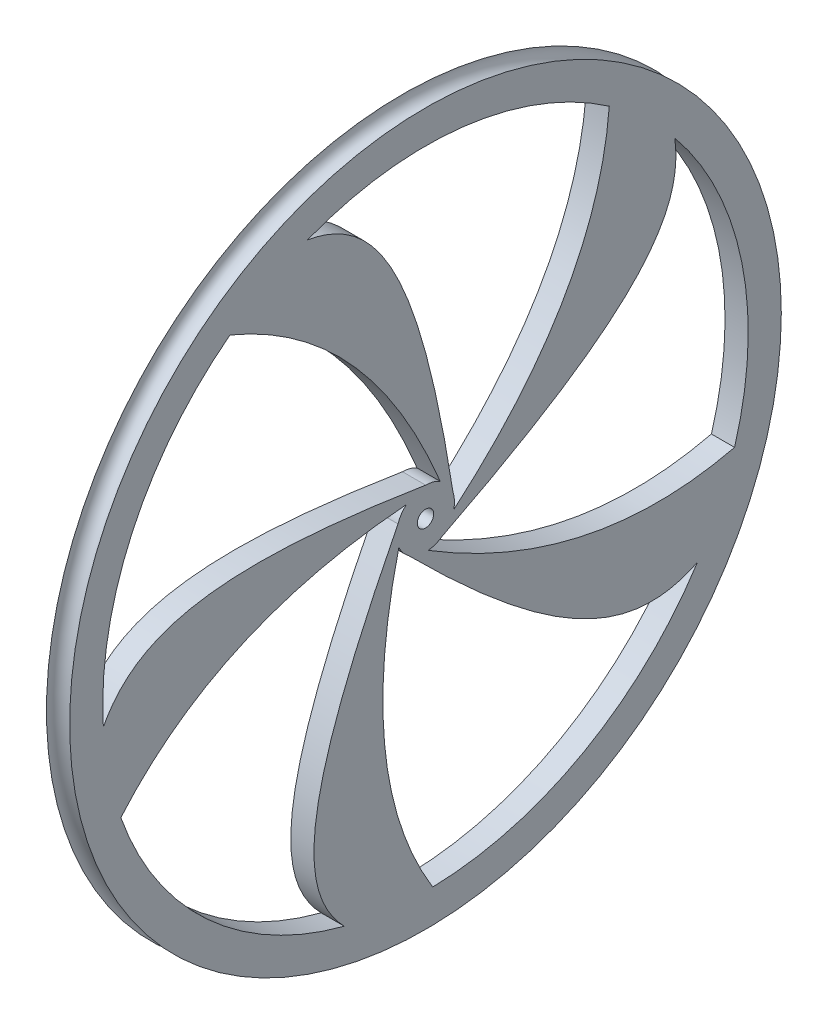
ISO-10303-21;
HEADER;
FILE_DESCRIPTION(('STEP AP214'),'2;1');
FILE_NAME('part.step','',(''),(''),'','','');
FILE_SCHEMA(('AUTOMOTIVE_DESIGN { 1 0 10303 214 1 1 1 1 }'));
ENDSEC;
DATA;
#1=APPLICATION_CONTEXT('core data for automotive mechanical design processes');
#2=APPLICATION_PROTOCOL_DEFINITION('international standard','automotive_design',2000,#1);
#3=PRODUCT_CONTEXT('',#1,'mechanical');
#4=PRODUCT('Part','Part','',(#3));
#5=PRODUCT_RELATED_PRODUCT_CATEGORY('part','',(#4));
#6=PRODUCT_DEFINITION_FORMATION('','',#4);
#7=PRODUCT_DEFINITION_CONTEXT('part definition',#1,'design');
#8=PRODUCT_DEFINITION('design','',#6,#7);
#9=PRODUCT_DEFINITION_SHAPE('','',#8);
#10=(LENGTH_UNIT() NAMED_UNIT(*) SI_UNIT(.MILLI.,.METRE.));
#11=(NAMED_UNIT(*) PLANE_ANGLE_UNIT() SI_UNIT($,.RADIAN.));
#12=(NAMED_UNIT(*) SI_UNIT($,.STERADIAN.) SOLID_ANGLE_UNIT());
#13=UNCERTAINTY_MEASURE_WITH_UNIT(LENGTH_MEASURE(1.E-05),#10,'distance_accuracy_value','');
#14=(GEOMETRIC_REPRESENTATION_CONTEXT(3) GLOBAL_UNCERTAINTY_ASSIGNED_CONTEXT((#13)) GLOBAL_UNIT_ASSIGNED_CONTEXT((#10,
#11,#12)) REPRESENTATION_CONTEXT('',''));
#15=CARTESIAN_POINT('',(0.,0.,0.));
#16=DIRECTION('',(0.,0.,1.));
#17=DIRECTION('',(1.,0.,0.));
#18=AXIS2_PLACEMENT_3D('',#15,#16,#17);
#19=CARTESIAN_POINT('',(0.,0.,0.));
#20=DIRECTION('',(1.,0.,0.));
#21=DIRECTION('',(0.,0.,-1.));
#22=AXIS2_PLACEMENT_3D('',#19,#20,#21);
#23=CYLINDRICAL_SURFACE('',#22,49.53);
#24=CARTESIAN_POINT('',(1.778,0.,0.));
#25=DIRECTION('',(1.,0.,0.));
#26=DIRECTION('',(0.,0.,-1.));
#27=AXIS2_PLACEMENT_3D('',#24,#25,#26);
#28=CIRCLE('',#27,49.53);
#29=CARTESIAN_POINT('',(1.778,-14.2449859048352,-47.4373405301251));
#30=VERTEX_POINT('',#29);
#31=CARTESIAN_POINT('',(1.778,31.4582822133367,-38.2569912589329));
#32=VERTEX_POINT('',#31);
#33=EDGE_CURVE('E189',#30,#32,#28,.T.);
#34=ORIENTED_EDGE('',*,*,#33,.T.);
#35=DIRECTION('',(-1.,0.,0.));
#36=VECTOR('',#35,1.);
#37=CARTESIAN_POINT('',(1.778,31.4582822133367,-38.2569912589329));
#38=LINE('',#37,#36);
#39=CARTESIAN_POINT('',(-1.778,31.4582822133367,-38.2569912589329));
#40=VERTEX_POINT('',#39);
#41=EDGE_CURVE('E65',#32,#40,#38,.T.);
#42=ORIENTED_EDGE('',*,*,#41,.T.);
#43=CARTESIAN_POINT('',(-1.778,0.,0.));
#44=DIRECTION('',(1.,0.,0.));
#45=DIRECTION('',(0.,0.,-1.));
#46=AXIS2_PLACEMENT_3D('',#43,#44,#45);
#47=CIRCLE('',#46,49.53);
#48=CARTESIAN_POINT('',(-1.778,-14.2449859048305,-47.4373405301265));
#49=VERTEX_POINT('',#48);
#50=EDGE_CURVE('E470',#49,#40,#47,.T.);
#51=ORIENTED_EDGE('',*,*,#50,.F.);
#52=DIRECTION('',(-1.,0.,0.));
#53=VECTOR('',#52,1.);
#54=CARTESIAN_POINT('',(1.778,-14.2449859048352,-47.4373405301251));
#55=LINE('',#54,#53);
#56=EDGE_CURVE('E244',#30,#49,#55,.T.);
#57=ORIENTED_EDGE('',*,*,#56,.F.);
#58=EDGE_LOOP('',(#34,#42,#51,#57));
#59=FACE_BOUND('',#58,.T.);
#60=ADVANCED_FACE('F41',(#59),#23,.F.);
#61=CARTESIAN_POINT('',(1.778,0.,0.));
#62=DIRECTION('',(-1.,0.,0.));
#63=DIRECTION('',(0.,0.,1.));
#64=AXIS2_PLACEMENT_3D('',#61,#62,#63);
#65=CYLINDRICAL_SURFACE('',#64,4.445);
#66=DIRECTION('',(-1.,0.,0.));
#67=VECTOR('',#66,1.);
#68=CARTESIAN_POINT('',(1.778,-3.61390194815136,-2.58799878461096));
#69=LINE('',#68,#67);
#70=CARTESIAN_POINT('',(1.778,-3.61390194815136,-2.58799878461096));
#71=VERTEX_POINT('',#70);
#72=CARTESIAN_POINT('',(-1.778,-3.61390194815815,-2.58799878460147));
#73=VERTEX_POINT('',#72);
#74=EDGE_CURVE('E547',#71,#73,#69,.T.);
#75=ORIENTED_EDGE('',*,*,#74,.F.);
#76=CARTESIAN_POINT('',(1.778,0.,0.));
#77=DIRECTION('',(1.,0.,0.));
#78=DIRECTION('',(0.,0.,-1.));
#79=AXIS2_PLACEMENT_3D('',#76,#77,#78);
#80=CIRCLE('',#79,4.445);
#81=CARTESIAN_POINT('',(1.778,-4.42596173429695,-0.410959519343637));
#82=VERTEX_POINT('',#81);
#83=EDGE_CURVE('E570',#82,#71,#80,.T.);
#84=ORIENTED_EDGE('',*,*,#83,.F.);
#85=DIRECTION('',(-1.,0.,0.));
#86=VECTOR('',#85,1.);
#87=CARTESIAN_POINT('',(1.778,-4.42596173429695,-0.410959519343637));
#88=LINE('',#87,#86);
#89=CARTESIAN_POINT('',(-1.778,-4.42596173429695,-0.410959519343637));
#90=VERTEX_POINT('',#89);
#91=EDGE_CURVE('E281',#82,#90,#88,.T.);
#92=ORIENTED_EDGE('',*,*,#91,.T.);
#93=CARTESIAN_POINT('',(-1.778,0.,0.));
#94=DIRECTION('',(1.,0.,0.));
#95=DIRECTION('',(0.,0.,-1.));
#96=AXIS2_PLACEMENT_3D('',#93,#94,#95);
#97=CIRCLE('',#96,4.445);
#98=EDGE_CURVE('E545',#90,#73,#97,.T.);
#99=ORIENTED_EDGE('',*,*,#98,.T.);
#100=EDGE_LOOP('',(#75,#84,#92,#99));
#101=FACE_BOUND('',#100,.T.);
#102=ADVANCED_FACE('F421',(#101),#65,.T.);
#103=CARTESIAN_POINT('',(1.778,-49.5175345561133,-1.11115772243385));
#104=VERTEX_POINT('',#103);
#105=CARTESIAN_POINT('',(1.778,-26.6634170128908,-41.7406647431098));
#106=VERTEX_POINT('',#105);
#107=EDGE_CURVE('E448',#104,#106,#28,.T.);
#108=ORIENTED_EDGE('',*,*,#107,.T.);
#109=DIRECTION('',(-1.,0.,0.));
#110=VECTOR('',#109,1.);
#111=CARTESIAN_POINT('',(1.778,-26.6634170128908,-41.7406647431098));
#112=LINE('',#111,#110);
#113=CARTESIAN_POINT('',(-1.778,-26.6634170128908,-41.7406647431098));
#114=VERTEX_POINT('',#113);
#115=EDGE_CURVE('E274',#106,#114,#112,.T.);
#116=ORIENTED_EDGE('',*,*,#115,.T.);
#117=CARTESIAN_POINT('',(-1.778,-49.5175345561132,-1.11115772243876));
#118=VERTEX_POINT('',#117);
#119=EDGE_CURVE('E467',#118,#114,#47,.T.);
#120=ORIENTED_EDGE('',*,*,#119,.F.);
#121=DIRECTION('',(-1.,0.,0.));
#122=VECTOR('',#121,1.);
#123=CARTESIAN_POINT('',(1.778,-49.5175345561133,-1.11115772243385));
#124=LINE('',#123,#122);
#125=EDGE_CURVE('E452',#104,#118,#124,.T.);
#126=ORIENTED_EDGE('',*,*,#125,.F.);
#127=EDGE_LOOP('',(#108,#116,#120,#126));
#128=FACE_BOUND('',#127,.T.);
#129=ADVANCED_FACE('F422',(#128),#23,.F.);
#130=DIRECTION('',(-1.,0.,0.));
#131=VECTOR('',#130,1.);
#132=CARTESIAN_POINT('',(1.778,-3.57809022625168,2.63728939117462));
#133=LINE('',#132,#131);
#134=CARTESIAN_POINT('',(1.778,-3.57809022625168,2.63728939117462));
#135=VERTEX_POINT('',#134);
#136=CARTESIAN_POINT('',(-1.778,-3.57809022624476,2.637289391184));
#137=VERTEX_POINT('',#136);
#138=EDGE_CURVE('E277',#135,#137,#133,.T.);
#139=ORIENTED_EDGE('',*,*,#138,.F.);
#140=CARTESIAN_POINT('',(1.778,-1.75854312115625,4.08234627279877));
#141=VERTEX_POINT('',#140);
#142=EDGE_CURVE('E460',#141,#135,#80,.T.);
#143=ORIENTED_EDGE('',*,*,#142,.F.);
#144=DIRECTION('',(-1.,0.,0.));
#145=VECTOR('',#144,1.);
#146=CARTESIAN_POINT('',(1.778,-1.75854312115625,4.08234627279877));
#147=LINE('',#146,#145);
#148=CARTESIAN_POINT('',(-1.778,-1.75854312115625,4.08234627279877));
#149=VERTEX_POINT('',#148);
#150=EDGE_CURVE('E339',#141,#149,#147,.T.);
#151=ORIENTED_EDGE('',*,*,#150,.T.);
#152=EDGE_CURVE('E465',#149,#137,#97,.T.);
#153=ORIENTED_EDGE('',*,*,#152,.T.);
#154=EDGE_LOOP('',(#139,#143,#151,#153));
#155=FACE_BOUND('',#154,.T.);
#156=ADVANCED_FACE('F434',(#155),#65,.T.);
#157=CARTESIAN_POINT('',(1.778,-16.35853348994,46.750607290799));
#158=VERTEX_POINT('',#157);
#159=CARTESIAN_POINT('',(1.778,-47.9371801835152,12.4598417346769));
#160=VERTEX_POINT('',#159);
#161=EDGE_CURVE('E456',#158,#160,#28,.T.);
#162=ORIENTED_EDGE('',*,*,#161,.T.);
#163=DIRECTION('',(-1.,0.,0.));
#164=VECTOR('',#163,1.);
#165=CARTESIAN_POINT('',(1.778,-47.9371801835152,12.4598417346769));
#166=LINE('',#165,#164);
#167=CARTESIAN_POINT('',(-1.778,-47.9371801835152,12.4598417346769));
#168=VERTEX_POINT('',#167);
#169=EDGE_CURVE('E589',#160,#168,#166,.T.);
#170=ORIENTED_EDGE('',*,*,#169,.T.);
#171=CARTESIAN_POINT('',(-1.778,-16.3585334899446,46.7506072907974));
#172=VERTEX_POINT('',#171);
#173=EDGE_CURVE('E50',#172,#168,#47,.T.);
#174=ORIENTED_EDGE('',*,*,#173,.F.);
#175=DIRECTION('',(-1.,0.,0.));
#176=VECTOR('',#175,1.);
#177=CARTESIAN_POINT('',(1.778,-16.35853348994,46.750607290799));
#178=LINE('',#177,#176);
#179=EDGE_CURVE('E323',#158,#172,#178,.T.);
#180=ORIENTED_EDGE('',*,*,#179,.F.);
#181=EDGE_LOOP('',(#162,#170,#174,#180));
#182=FACE_BOUND('',#181,.T.);
#183=ADVANCED_FACE('F426',(#182),#23,.F.);
#184=DIRECTION('',(-1.,0.,0.));
#185=VECTOR('',#184,1.);
#186=CARTESIAN_POINT('',(1.778,1.40252057351404,4.21793326652637));
#187=LINE('',#186,#185);
#188=CARTESIAN_POINT('',(1.778,1.40252057351404,4.21793326652637));
#189=VERTEX_POINT('',#188);
#190=CARTESIAN_POINT('',(-1.778,1.40252057352511,4.21793326652269));
#191=VERTEX_POINT('',#190);
#192=EDGE_CURVE('E586',#189,#191,#187,.T.);
#193=ORIENTED_EDGE('',*,*,#192,.F.);
#194=CARTESIAN_POINT('',(1.778,3.33912231474007,2.93398826977971));
#195=VERTEX_POINT('',#194);
#196=EDGE_CURVE('E377',#195,#189,#80,.T.);
#197=ORIENTED_EDGE('',*,*,#196,.F.);
#198=DIRECTION('',(-1.,0.,0.));
#199=VECTOR('',#198,1.);
#200=CARTESIAN_POINT('',(1.778,3.33912231474007,2.93398826977971));
#201=LINE('',#200,#199);
#202=CARTESIAN_POINT('',(-1.778,3.33912231474007,2.93398826977971));
#203=VERTEX_POINT('',#202);
#204=EDGE_CURVE('E361',#195,#203,#201,.T.);
#205=ORIENTED_EDGE('',*,*,#204,.T.);
#206=EDGE_CURVE('E384',#203,#191,#97,.T.);
#207=ORIENTED_EDGE('',*,*,#206,.T.);
#208=EDGE_LOOP('',(#193,#197,#205,#207));
#209=FACE_BOUND('',#208,.T.);
#210=ADVANCED_FACE('F424',(#209),#65,.T.);
#211=CARTESIAN_POINT('',(1.778,39.407404853227,30.004622022846));
#212=VERTEX_POINT('',#211);
#213=CARTESIAN_POINT('',(1.778,-2.96338966534929,49.4412704295844));
#214=VERTEX_POINT('',#213);
#215=EDGE_CURVE('E191',#212,#214,#28,.T.);
#216=ORIENTED_EDGE('',*,*,#215,.T.);
#217=DIRECTION('',(-1.,0.,0.));
#218=VECTOR('',#217,1.);
#219=CARTESIAN_POINT('',(1.778,-2.9633896653493,49.4412704295844));
#220=LINE('',#219,#218);
#221=CARTESIAN_POINT('',(-1.778,-2.96338966534929,49.4412704295844));
#222=VERTEX_POINT('',#221);
#223=EDGE_CURVE('E354',#214,#222,#220,.T.);
#224=ORIENTED_EDGE('',*,*,#223,.T.);
#225=CARTESIAN_POINT('',(-1.778,39.4074048532241,30.00462202285));
#226=VERTEX_POINT('',#225);
#227=EDGE_CURVE('E11',#226,#222,#47,.T.);
#228=ORIENTED_EDGE('',*,*,#227,.F.);
#229=DIRECTION('',(-1.,0.,0.));
#230=VECTOR('',#229,1.);
#231=CARTESIAN_POINT('',(1.778,39.407404853227,30.004622022846));
#232=LINE('',#231,#230);
#233=EDGE_CURVE('E499',#212,#226,#232,.T.);
#234=ORIENTED_EDGE('',*,*,#233,.F.);
#235=EDGE_LOOP('',(#216,#224,#228,#234));
#236=FACE_BOUND('',#235,.T.);
#237=ADVANCED_FACE('F414',(#236),#23,.F.);
#238=DIRECTION('',(-1.,0.,0.));
#239=VECTOR('',#238,1.);
#240=CARTESIAN_POINT('',(1.778,4.44489561060435,-0.0304632701824713));
#241=LINE('',#240,#239);
#242=CARTESIAN_POINT('',(1.778,4.44489561060435,-0.0304632701824713));
#243=VERTEX_POINT('',#242);
#244=CARTESIAN_POINT('',(-1.778,4.44489561060427,-0.0304632701941348));
#245=VERTEX_POINT('',#244);
#246=EDGE_CURVE('E357',#243,#245,#241,.T.);
#247=ORIENTED_EDGE('',*,*,#246,.F.);
#248=CARTESIAN_POINT('',(1.778,3.82223420425882,-2.26904179948143));
#249=VERTEX_POINT('',#248);
#250=EDGE_CURVE('E372',#249,#243,#80,.T.);
#251=ORIENTED_EDGE('',*,*,#250,.F.);
#252=DIRECTION('',(-1.,0.,0.));
#253=VECTOR('',#252,1.);
#254=CARTESIAN_POINT('',(1.778,3.82223420425882,-2.26904179948143));
#255=LINE('',#254,#253);
#256=CARTESIAN_POINT('',(-1.778,3.82223420425882,-2.26904179948143));
#257=VERTEX_POINT('',#256);
#258=EDGE_CURVE('E489',#249,#257,#255,.T.);
#259=ORIENTED_EDGE('',*,*,#258,.T.);
#260=EDGE_CURVE('E371',#257,#245,#97,.T.);
#261=ORIENTED_EDGE('',*,*,#260,.T.);
#262=EDGE_LOOP('',(#247,#251,#259,#261));
#263=FACE_BOUND('',#262,.T.);
#264=ADVANCED_FACE('F418',(#263),#65,.T.);
#265=CARTESIAN_POINT('',(-1.778,49.53,0.));
#266=DIRECTION('',(-1.,0.,0.));
#267=DIRECTION('',(0.,0.,1.));
#268=AXIS2_PLACEMENT_3D('',#265,#266,#267);
#269=PLANE('',#268);
#270=CARTESIAN_POINT('',(-1.778,-0.976851663545671,-4.33633322375346));
#271=CARTESIAN_POINT('',(-1.778,26.7954299976754,-36.9029526181963));
#272=CARTESIAN_POINT('',(-1.778,63.374014977111,-25.3335626529753));
#273=B_SPLINE_CURVE_WITH_KNOTS('',2,(#270,#271,#272),.UNSPECIFIED.,.F.,.F.,(3,3),(0.,1.),.UNSPECIFIED.);
#274=CARTESIAN_POINT('',(-1.778,-0.976851663545671,-4.33633322375346));
#275=VERTEX_POINT('',#274);
#276=CARTESIAN_POINT('',(-1.778,40.7136490976649,-28.2067310610821));
#277=VERTEX_POINT('',#276);
#278=EDGE_CURVE('E212',#275,#277,#273,.T.);
#279=ORIENTED_EDGE('',*,*,#278,.T.);
#280=CARTESIAN_POINT('',(-1.778,46.1057046484192,18.0965438377812));
#281=VERTEX_POINT('',#280);
#282=EDGE_CURVE('E51',#277,#281,#47,.T.);
#283=ORIENTED_EDGE('',*,*,#282,.T.);
#284=CARTESIAN_POINT('',(-1.778,0.,-4.445));
#285=CARTESIAN_POINT('',(-1.778,33.4176853978856,0.66300653128449));
#286=CARTESIAN_POINT('',(-1.778,51.9235775687338,11.9659401115343));
#287=CARTESIAN_POINT('',(-1.778,44.2773548932721,35.803029836681));
#288=CARTESIAN_POINT('',(-1.778,43.6772974717841,52.4437685199361));
#289=B_SPLINE_CURVE_WITH_KNOTS('',3,(#284,#285,#286,#287,#288),.UNSPECIFIED.,.F.,.F.,(4,1,4),
(0.,0.5828413419792,1.),.UNSPECIFIED.);
#290=CARTESIAN_POINT('',(-1.778,1.34457599028464,-4.23676060290761));
#291=VERTEX_POINT('',#290);
#292=EDGE_CURVE('E392',#291,#281,#289,.T.);
#293=ORIENTED_EDGE('',*,*,#292,.F.);
#294=EDGE_CURVE('E381',#275,#291,#97,.T.);
#295=ORIENTED_EDGE('',*,*,#294,.F.);
#296=EDGE_LOOP('',(#279,#283,#293,#295));
#297=FACE_BOUND('',#296,.T.);
#298=CARTESIAN_POINT('',(-1.778,-4.42596173429695,-0.410959519343637));
#299=CARTESIAN_POINT('',(-1.778,-26.816550317201,-36.8876078078559));
#300=CARTESIAN_POINT('',(-1.778,-4.51000221238416,-68.1007712955999));
#301=B_SPLINE_CURVE_WITH_KNOTS('',2,(#298,#299,#300),.UNSPECIFIED.,.F.,.F.,(3,3),(0.,1.),.UNSPECIFIED.);
#302=EDGE_CURVE('E250',#90,#49,#301,.T.);
#303=ORIENTED_EDGE('',*,*,#302,.T.);
#304=ORIENTED_EDGE('',*,*,#50,.T.);
#305=CARTESIAN_POINT('',(-1.778,-4.22744621493194,-1.37358053999669));
#306=CARTESIAN_POINT('',(-1.778,10.9571893825469,-31.5772271716119));
#307=CARTESIAN_POINT('',(-1.778,27.4255531941573,-45.6845779479639));
#308=CARTESIAN_POINT('',(-1.778,47.7331599572775,-31.0465222259113));
#309=CARTESIAN_POINT('',(-1.778,63.3740149771114,-25.3335626529752));
#310=B_SPLINE_CURVE_WITH_KNOTS('',3,(#305,#306,#307,#308,#309),.UNSPECIFIED.,.F.,.F.,(4,1,4),
(0.,0.5828413419792,1.),.UNSPECIFIED.);
#311=EDGE_CURVE('E205',#73,#40,#310,.T.);
#312=ORIENTED_EDGE('',*,*,#311,.F.);
#313=ORIENTED_EDGE('',*,*,#98,.F.);
#314=EDGE_LOOP('',(#303,#304,#312,#313));
#315=FACE_BOUND('',#314,.T.);
#316=CARTESIAN_POINT('',(-1.778,-1.75854312115625,4.08234627279877));
#317=CARTESIAN_POINT('',(-1.778,-43.3689695547273,14.1051572292656));
#318=CARTESIAN_POINT('',(-1.778,-66.1613496337016,-16.7550286677883));
#319=B_SPLINE_CURVE_WITH_KNOTS('',2,(#316,#317,#318),.UNSPECIFIED.,.F.,.F.,(3,3),(0.,1.),.UNSPECIFIED.);
#320=EDGE_CURVE('E285',#149,#118,#319,.T.);
#321=ORIENTED_EDGE('',*,*,#320,.T.);
#322=ORIENTED_EDGE('',*,*,#119,.T.);
#323=CARTESIAN_POINT('',(-1.778,-2.61270544644007,3.59608053999662));
#324=CARTESIAN_POINT('',(-1.778,-26.6457699383022,-20.1788061938176));
#325=CARTESIAN_POINT('',(-1.778,-34.9736535344763,-40.2005620450704));
#326=CARTESIAN_POINT('',(-1.778,-14.7766396492389,-54.9908358047737));
#327=CARTESIAN_POINT('',(-1.778,-4.51000221238391,-68.1007712956002));
#328=B_SPLINE_CURVE_WITH_KNOTS('',3,(#323,#324,#325,#326,#327),.UNSPECIFIED.,.F.,.F.,(4,1,4),
(0.,0.5828413419792,1.),.UNSPECIFIED.);
#329=EDGE_CURVE('E259',#137,#114,#328,.T.);
#330=ORIENTED_EDGE('',*,*,#329,.F.);
#331=ORIENTED_EDGE('',*,*,#152,.F.);
#332=EDGE_LOOP('',(#321,#322,#330,#331));
#333=FACE_BOUND('',#332,.T.);
#334=CARTESIAN_POINT('',(-1.778,3.33912231474007,2.93398826977971));
#335=CARTESIAN_POINT('',(-1.778,0.0130530753204294,45.6050743922032));
#336=CARTESIAN_POINT('',(-1.778,-36.3799606028085,57.745594096428));
#337=B_SPLINE_CURVE_WITH_KNOTS('',2,(#334,#335,#336),.UNSPECIFIED.,.F.,.F.,(3,3),(0.,1.),.UNSPECIFIED.);
#338=EDGE_CURVE('E329',#203,#172,#337,.T.);
#339=ORIENTED_EDGE('',*,*,#338,.T.);
#340=ORIENTED_EDGE('',*,*,#173,.T.);
#341=CARTESIAN_POINT('',(-1.778,2.61270544644003,3.59608053999665));
#342=CARTESIAN_POINT('',(-1.778,-27.4251808608277,19.1060390914358));
#343=CARTESIAN_POINT('',(-1.778,-49.0404597892263,20.8392642372616));
#344=CARTESIAN_POINT('',(-1.778,-56.8656255000164,-2.93968337120324));
#345=CARTESIAN_POINT('',(-1.778,-66.1613496337018,-16.7550286677886));
#346=B_SPLINE_CURVE_WITH_KNOTS('',3,(#341,#342,#343,#344,#345),.UNSPECIFIED.,.F.,.F.,(4,1,4),
(0.,0.5828413419792,1.),.UNSPECIFIED.);
#347=EDGE_CURVE('E294',#191,#168,#346,.T.);
#348=ORIENTED_EDGE('',*,*,#347,.F.);
#349=ORIENTED_EDGE('',*,*,#206,.F.);
#350=EDGE_LOOP('',(#339,#340,#348,#349));
#351=FACE_BOUND('',#350,.T.);
#352=ORIENTED_EDGE('',*,*,#227,.T.);
#353=CARTESIAN_POINT('',(-1.778,4.22744621493196,-1.37358053999663));
#354=CARTESIAN_POINT('',(-1.778,9.69607601869772,31.986987742709));
#355=CARTESIAN_POINT('',(-1.778,4.66498256081217,53.0799356442381));
#356=CARTESIAN_POINT('',(-1.778,-20.3682497012936,53.1740115652073));
#357=CARTESIAN_POINT('',(-1.778,-36.3799606028089,57.7455940964281));
#358=B_SPLINE_CURVE_WITH_KNOTS('',3,(#353,#354,#355,#356,#357),.UNSPECIFIED.,.F.,.F.,(4,1,4),
(0.,0.5828413419792,1.),.UNSPECIFIED.);
#359=EDGE_CURVE('E338',#245,#222,#358,.T.);
#360=ORIENTED_EDGE('',*,*,#359,.F.);
#361=ORIENTED_EDGE('',*,*,#260,.F.);
#362=CARTESIAN_POINT('',(-1.778,3.82223420425882,-2.26904179948143));
#363=CARTESIAN_POINT('',(-1.778,43.377036798933,14.0803288045832));
#364=CARTESIAN_POINT('',(-1.778,43.6772974717841,52.4437685199357));
#365=B_SPLINE_CURVE_WITH_KNOTS('',2,(#362,#363,#364),.UNSPECIFIED.,.F.,.F.,(3,3),(0.,1.),.UNSPECIFIED.);
#366=EDGE_CURVE('E376',#257,#226,#365,.T.);
#367=ORIENTED_EDGE('',*,*,#366,.T.);
#368=EDGE_LOOP('',(#352,#360,#361,#367));
#369=FACE_BOUND('',#368,.T.);
#370=CARTESIAN_POINT('',(-1.778,0.,0.));
#371=DIRECTION('',(1.,0.,0.));
#372=DIRECTION('',(0.,0.,-1.));
#373=AXIS2_PLACEMENT_3D('',#370,#371,#372);
#374=CIRCLE('',#373,54.61);
#375=CARTESIAN_POINT('',(-1.778,0.,-54.61));
#376=VERTEX_POINT('',#375);
#377=EDGE_CURVE('E485',#376,#376,#374,.T.);
#378=ORIENTED_EDGE('',*,*,#377,.F.);
#379=EDGE_LOOP('',(#378));
#380=FACE_BOUND('',#379,.T.);
#381=CARTESIAN_POINT('',(-1.778,0.,0.));
#382=DIRECTION('',(1.,0.,0.));
#383=DIRECTION('',(0.,0.,-1.));
#384=AXIS2_PLACEMENT_3D('',#381,#382,#383);
#385=CIRCLE('',#384,1.2573);
#386=CARTESIAN_POINT('',(-1.778,0.,-1.2573));
#387=VERTEX_POINT('',#386);
#388=EDGE_CURVE('E365',#387,#387,#385,.T.);
#389=ORIENTED_EDGE('',*,*,#388,.T.);
#390=EDGE_LOOP('',(#389));
#391=FACE_BOUND('',#390,.T.);
#392=ADVANCED_FACE('F43',(#297,#315,#333,#351,#369,#380,#391),#269,.T.);
#393=DIRECTION('',(-1.,0.,0.));
#394=VECTOR('',#393,1.);
#395=CARTESIAN_POINT('',(1.778,40.7136490976621,-28.2067310610861));
#396=LINE('',#395,#394);
#397=CARTESIAN_POINT('',(1.778,40.7136490976621,-28.2067310610861));
#398=VERTEX_POINT('',#397);
#399=EDGE_CURVE('E192',#398,#277,#396,.T.);
#400=ORIENTED_EDGE('',*,*,#399,.F.);
#401=CARTESIAN_POINT('',(1.778,46.1057046484192,18.0965438377812));
#402=VERTEX_POINT('',#401);
#403=EDGE_CURVE('E180',#398,#402,#28,.T.);
#404=ORIENTED_EDGE('',*,*,#403,.T.);
#405=DIRECTION('',(-1.,0.,0.));
#406=VECTOR('',#405,1.);
#407=CARTESIAN_POINT('',(1.778,46.1057046484192,18.0965438377812));
#408=LINE('',#407,#406);
#409=EDGE_CURVE('E496',#402,#281,#408,.T.);
#410=ORIENTED_EDGE('',*,*,#409,.T.);
#411=ORIENTED_EDGE('',*,*,#282,.F.);
#412=EDGE_LOOP('',(#400,#404,#410,#411));
#413=FACE_BOUND('',#412,.T.);
#414=ADVANCED_FACE('F193',(#413),#23,.F.);
#415=CARTESIAN_POINT('',(1.778,49.53,0.));
#416=DIRECTION('',(1.,0.,0.));
#417=DIRECTION('',(0.,0.,-1.));
#418=AXIS2_PLACEMENT_3D('',#415,#416,#417);
#419=PLANE('',#418);
#420=ORIENTED_EDGE('',*,*,#403,.F.);
#421=CARTESIAN_POINT('',(1.778,-0.976851663545671,-4.33633322375346));
#422=CARTESIAN_POINT('',(1.778,26.7954299976754,-36.9029526181963));
#423=CARTESIAN_POINT('',(1.778,63.374014977111,-25.3335626529753));
#424=B_SPLINE_CURVE_WITH_KNOTS('',2,(#421,#422,#423),.UNSPECIFIED.,.F.,.F.,(3,3),(0.,1.),.UNSPECIFIED.);
#425=CARTESIAN_POINT('',(1.778,-0.976851663545671,-4.33633322375346));
#426=VERTEX_POINT('',#425);
#427=EDGE_CURVE('E184',#426,#398,#424,.T.);
#428=ORIENTED_EDGE('',*,*,#427,.F.);
#429=CARTESIAN_POINT('',(1.778,1.34457599028464,-4.23676060290761));
#430=VERTEX_POINT('',#429);
#431=EDGE_CURVE('E370',#426,#430,#80,.T.);
#432=ORIENTED_EDGE('',*,*,#431,.T.);
#433=CARTESIAN_POINT('',(1.778,0.,-4.445));
#434=CARTESIAN_POINT('',(1.778,33.4176853978856,0.66300653128449));
#435=CARTESIAN_POINT('',(1.778,51.9235775687338,11.9659401115343));
#436=CARTESIAN_POINT('',(1.778,44.2773548932721,35.803029836681));
#437=CARTESIAN_POINT('',(1.778,43.6772974717841,52.4437685199361));
#438=B_SPLINE_CURVE_WITH_KNOTS('',3,(#433,#434,#435,#436,#437),.UNSPECIFIED.,.F.,.F.,(4,1,4),
(0.,0.5828413419792,1.),.UNSPECIFIED.);
#439=EDGE_CURVE('E186',#430,#402,#438,.T.);
#440=ORIENTED_EDGE('',*,*,#439,.T.);
#441=EDGE_LOOP('',(#420,#428,#432,#440));
#442=FACE_BOUND('',#441,.T.);
#443=ORIENTED_EDGE('',*,*,#33,.F.);
#444=CARTESIAN_POINT('',(1.778,-4.42596173429695,-0.410959519343637));
#445=CARTESIAN_POINT('',(1.778,-26.816550317201,-36.8876078078559));
#446=CARTESIAN_POINT('',(1.778,-4.51000221238416,-68.1007712955999));
#447=B_SPLINE_CURVE_WITH_KNOTS('',2,(#444,#445,#446),.UNSPECIFIED.,.F.,.F.,(3,3),(0.,1.),.UNSPECIFIED.);
#448=EDGE_CURVE('E245',#82,#30,#447,.T.);
#449=ORIENTED_EDGE('',*,*,#448,.F.);
#450=ORIENTED_EDGE('',*,*,#83,.T.);
#451=CARTESIAN_POINT('',(1.778,-4.22744621493194,-1.37358053999669));
#452=CARTESIAN_POINT('',(1.778,10.9571893825469,-31.5772271716119));
#453=CARTESIAN_POINT('',(1.778,27.4255531941573,-45.6845779479639));
#454=CARTESIAN_POINT('',(1.778,47.7331599572775,-31.0465222259113));
#455=CARTESIAN_POINT('',(1.778,63.3740149771114,-25.3335626529752));
#456=B_SPLINE_CURVE_WITH_KNOTS('',3,(#451,#452,#453,#454,#455),.UNSPECIFIED.,.F.,.F.,(4,1,4),
(0.,0.5828413419792,1.),.UNSPECIFIED.);
#457=EDGE_CURVE('E198',#71,#32,#456,.T.);
#458=ORIENTED_EDGE('',*,*,#457,.T.);
#459=EDGE_LOOP('',(#443,#449,#450,#458));
#460=FACE_BOUND('',#459,.T.);
#461=ORIENTED_EDGE('',*,*,#107,.F.);
#462=CARTESIAN_POINT('',(1.778,-1.75854312115625,4.08234627279877));
#463=CARTESIAN_POINT('',(1.778,-43.3689695547273,14.1051572292656));
#464=CARTESIAN_POINT('',(1.778,-66.1613496337016,-16.7550286677883));
#465=B_SPLINE_CURVE_WITH_KNOTS('',2,(#462,#463,#464),.UNSPECIFIED.,.F.,.F.,(3,3),(0.,1.),.UNSPECIFIED.);
#466=EDGE_CURVE('E286',#141,#104,#465,.T.);
#467=ORIENTED_EDGE('',*,*,#466,.F.);
#468=ORIENTED_EDGE('',*,*,#142,.T.);
#469=CARTESIAN_POINT('',(1.778,-2.61270544644007,3.59608053999662));
#470=CARTESIAN_POINT('',(1.778,-26.6457699383022,-20.1788061938176));
#471=CARTESIAN_POINT('',(1.778,-34.9736535344763,-40.2005620450704));
#472=CARTESIAN_POINT('',(1.778,-14.7766396492389,-54.9908358047737));
#473=CARTESIAN_POINT('',(1.778,-4.51000221238391,-68.1007712956002));
#474=B_SPLINE_CURVE_WITH_KNOTS('',3,(#469,#470,#471,#472,#473),.UNSPECIFIED.,.F.,.F.,(4,1,4),
(0.,0.5828413419792,1.),.UNSPECIFIED.);
#475=EDGE_CURVE('E237',#135,#106,#474,.T.);
#476=ORIENTED_EDGE('',*,*,#475,.T.);
#477=EDGE_LOOP('',(#461,#467,#468,#476));
#478=FACE_BOUND('',#477,.T.);
#479=ORIENTED_EDGE('',*,*,#161,.F.);
#480=CARTESIAN_POINT('',(1.778,3.33912231474007,2.93398826977971));
#481=CARTESIAN_POINT('',(1.778,0.0130530753204294,45.6050743922032));
#482=CARTESIAN_POINT('',(1.778,-36.3799606028085,57.745594096428));
#483=B_SPLINE_CURVE_WITH_KNOTS('',2,(#480,#481,#482),.UNSPECIFIED.,.F.,.F.,(3,3),(0.,1.),.UNSPECIFIED.);
#484=EDGE_CURVE('E324',#195,#158,#483,.T.);
#485=ORIENTED_EDGE('',*,*,#484,.F.);
#486=ORIENTED_EDGE('',*,*,#196,.T.);
#487=CARTESIAN_POINT('',(1.778,2.61270544644003,3.59608053999665));
#488=CARTESIAN_POINT('',(1.778,-27.4251808608277,19.1060390914358));
#489=CARTESIAN_POINT('',(1.778,-49.0404597892263,20.8392642372616));
#490=CARTESIAN_POINT('',(1.778,-56.8656255000164,-2.93968337120324));
#491=CARTESIAN_POINT('',(1.778,-66.1613496337018,-16.7550286677886));
#492=B_SPLINE_CURVE_WITH_KNOTS('',3,(#487,#488,#489,#490,#491),.UNSPECIFIED.,.F.,.F.,(4,1,4),
(0.,0.5828413419792,1.),.UNSPECIFIED.);
#493=EDGE_CURVE('E293',#189,#160,#492,.T.);
#494=ORIENTED_EDGE('',*,*,#493,.T.);
#495=EDGE_LOOP('',(#479,#485,#486,#494));
#496=FACE_BOUND('',#495,.T.);
#497=CARTESIAN_POINT('',(1.778,0.,0.));
#498=DIRECTION('',(1.,0.,0.));
#499=DIRECTION('',(0.,0.,-1.));
#500=AXIS2_PLACEMENT_3D('',#497,#498,#499);
#501=CIRCLE('',#500,54.61);
#502=CARTESIAN_POINT('',(1.778,0.,-54.61));
#503=VERTEX_POINT('',#502);
#504=EDGE_CURVE('E190',#503,#503,#501,.T.);
#505=ORIENTED_EDGE('',*,*,#504,.T.);
#506=EDGE_LOOP('',(#505));
#507=FACE_BOUND('',#506,.T.);
#508=ORIENTED_EDGE('',*,*,#215,.F.);
#509=CARTESIAN_POINT('',(1.778,3.82223420425882,-2.26904179948143));
#510=CARTESIAN_POINT('',(1.778,43.377036798933,14.0803288045832));
#511=CARTESIAN_POINT('',(1.778,43.6772974717841,52.4437685199357));
#512=B_SPLINE_CURVE_WITH_KNOTS('',2,(#509,#510,#511),.UNSPECIFIED.,.F.,.F.,(3,3),(0.,1.),.UNSPECIFIED.);
#513=EDGE_CURVE('E385',#249,#212,#512,.T.);
#514=ORIENTED_EDGE('',*,*,#513,.F.);
#515=ORIENTED_EDGE('',*,*,#250,.T.);
#516=CARTESIAN_POINT('',(1.778,4.22744621493196,-1.37358053999663));
#517=CARTESIAN_POINT('',(1.778,9.69607601869772,31.986987742709));
#518=CARTESIAN_POINT('',(1.778,4.66498256081217,53.0799356442381));
#519=CARTESIAN_POINT('',(1.778,-20.3682497012936,53.1740115652073));
#520=CARTESIAN_POINT('',(1.778,-36.3799606028089,57.7455940964281));
#521=B_SPLINE_CURVE_WITH_KNOTS('',3,(#516,#517,#518,#519,#520),.UNSPECIFIED.,.F.,.F.,(4,1,4),
(0.,0.5828413419792,1.),.UNSPECIFIED.);
#522=EDGE_CURVE('E316',#243,#214,#521,.T.);
#523=ORIENTED_EDGE('',*,*,#522,.T.);
#524=EDGE_LOOP('',(#508,#514,#515,#523));
#525=FACE_BOUND('',#524,.T.);
#526=CARTESIAN_POINT('',(1.778,0.,0.));
#527=DIRECTION('',(1.,0.,0.));
#528=DIRECTION('',(0.,0.,-1.));
#529=AXIS2_PLACEMENT_3D('',#526,#527,#528);
#530=CIRCLE('',#529,1.2573);
#531=CARTESIAN_POINT('',(1.778,0.,-1.2573));
#532=VERTEX_POINT('',#531);
#533=EDGE_CURVE('E366',#532,#532,#530,.T.);
#534=ORIENTED_EDGE('',*,*,#533,.F.);
#535=EDGE_LOOP('',(#534));
#536=FACE_BOUND('',#535,.T.);
#537=ADVANCED_FACE('F181',(#442,#460,#478,#496,#507,#525,#536),#419,.T.);
#538=CARTESIAN_POINT('',(0.,0.,0.));
#539=DIRECTION('',(1.,0.,0.));
#540=DIRECTION('',(0.,0.,-1.));
#541=AXIS2_PLACEMENT_3D('',#538,#539,#540);
#542=TOROIDAL_SURFACE('',#541,54.61,1.778);
#543=ORIENTED_EDGE('',*,*,#377,.T.);
#544=EDGE_LOOP('',(#543));
#545=FACE_BOUND('',#544,.T.);
#546=ORIENTED_EDGE('',*,*,#504,.F.);
#547=EDGE_LOOP('',(#546));
#548=FACE_BOUND('',#547,.T.);
#549=ADVANCED_FACE('F406',(#545,#548),#542,.F.);
#550=DIRECTION('',(-1.,0.,0.));
#551=VECTOR('',#550,1.);
#552=SURFACE_OF_LINEAR_EXTRUSION('',#512,#551);
#553=ORIENTED_EDGE('',*,*,#366,.F.);
#554=ORIENTED_EDGE('',*,*,#258,.F.);
#555=ORIENTED_EDGE('',*,*,#513,.T.);
#556=ORIENTED_EDGE('',*,*,#233,.T.);
#557=EDGE_LOOP('',(#553,#554,#555,#556));
#558=FACE_BOUND('',#557,.T.);
#559=ADVANCED_FACE('F401',(#558),#552,.T.);
#560=DIRECTION('',(-1.,0.,0.));
#561=VECTOR('',#560,1.);
#562=SURFACE_OF_LINEAR_EXTRUSION('',#438,#561);
#563=ORIENTED_EDGE('',*,*,#292,.T.);
#564=ORIENTED_EDGE('',*,*,#409,.F.);
#565=ORIENTED_EDGE('',*,*,#439,.F.);
#566=DIRECTION('',(-1.,0.,0.));
#567=VECTOR('',#566,1.);
#568=CARTESIAN_POINT('',(1.778,1.34457599028464,-4.23676060290761));
#569=LINE('',#568,#567);
#570=EDGE_CURVE('E492',#430,#291,#569,.T.);
#571=ORIENTED_EDGE('',*,*,#570,.T.);
#572=EDGE_LOOP('',(#563,#564,#565,#571));
#573=FACE_BOUND('',#572,.T.);
#574=ADVANCED_FACE('F405',(#573),#562,.F.);
#575=CARTESIAN_POINT('',(1.778,0.,0.));
#576=DIRECTION('',(-1.,0.,0.));
#577=DIRECTION('',(0.,0.,1.));
#578=AXIS2_PLACEMENT_3D('',#575,#576,#577);
#579=CYLINDRICAL_SURFACE('',#578,1.2573);
#580=ORIENTED_EDGE('',*,*,#533,.T.);
#581=EDGE_LOOP('',(#580));
#582=FACE_BOUND('',#581,.T.);
#583=ORIENTED_EDGE('',*,*,#388,.F.);
#584=EDGE_LOOP('',(#583));
#585=FACE_BOUND('',#584,.T.);
#586=ADVANCED_FACE('F530',(#582,#585),#579,.F.);
#587=ORIENTED_EDGE('',*,*,#431,.F.);
#588=DIRECTION('',(-1.,0.,0.));
#589=VECTOR('',#588,1.);
#590=CARTESIAN_POINT('',(1.778,-0.976851663545671,-4.33633322375346));
#591=LINE('',#590,#589);
#592=EDGE_CURVE('E203',#426,#275,#591,.T.);
#593=ORIENTED_EDGE('',*,*,#592,.T.);
#594=ORIENTED_EDGE('',*,*,#294,.T.);
#595=ORIENTED_EDGE('',*,*,#570,.F.);
#596=EDGE_LOOP('',(#587,#593,#594,#595));
#597=FACE_BOUND('',#596,.T.);
#598=ADVANCED_FACE('F432',(#597),#65,.T.);
#599=DIRECTION('',(-1.,0.,0.));
#600=VECTOR('',#599,1.);
#601=SURFACE_OF_LINEAR_EXTRUSION('',#483,#600);
#602=ORIENTED_EDGE('',*,*,#338,.F.);
#603=ORIENTED_EDGE('',*,*,#204,.F.);
#604=ORIENTED_EDGE('',*,*,#484,.T.);
#605=ORIENTED_EDGE('',*,*,#179,.T.);
#606=EDGE_LOOP('',(#602,#603,#604,#605));
#607=FACE_BOUND('',#606,.T.);
#608=ADVANCED_FACE('F312',(#607),#601,.T.);
#609=DIRECTION('',(-1.,0.,0.));
#610=VECTOR('',#609,1.);
#611=SURFACE_OF_LINEAR_EXTRUSION('',#521,#610);
#612=ORIENTED_EDGE('',*,*,#359,.T.);
#613=ORIENTED_EDGE('',*,*,#223,.F.);
#614=ORIENTED_EDGE('',*,*,#522,.F.);
#615=ORIENTED_EDGE('',*,*,#246,.T.);
#616=EDGE_LOOP('',(#612,#613,#614,#615));
#617=FACE_BOUND('',#616,.T.);
#618=ADVANCED_FACE('F307',(#617),#611,.F.);
#619=DIRECTION('',(-1.,0.,0.));
#620=VECTOR('',#619,1.);
#621=SURFACE_OF_LINEAR_EXTRUSION('',#465,#620);
#622=ORIENTED_EDGE('',*,*,#320,.F.);
#623=ORIENTED_EDGE('',*,*,#150,.F.);
#624=ORIENTED_EDGE('',*,*,#466,.T.);
#625=ORIENTED_EDGE('',*,*,#125,.T.);
#626=EDGE_LOOP('',(#622,#623,#624,#625));
#627=FACE_BOUND('',#626,.T.);
#628=ADVANCED_FACE('F303',(#627),#621,.T.);
#629=DIRECTION('',(-1.,0.,0.));
#630=VECTOR('',#629,1.);
#631=SURFACE_OF_LINEAR_EXTRUSION('',#492,#630);
#632=ORIENTED_EDGE('',*,*,#347,.T.);
#633=ORIENTED_EDGE('',*,*,#169,.F.);
#634=ORIENTED_EDGE('',*,*,#493,.F.);
#635=ORIENTED_EDGE('',*,*,#192,.T.);
#636=EDGE_LOOP('',(#632,#633,#634,#635));
#637=FACE_BOUND('',#636,.T.);
#638=ADVANCED_FACE('F306',(#637),#631,.F.);
#639=DIRECTION('',(-1.,0.,0.));
#640=VECTOR('',#639,1.);
#641=SURFACE_OF_LINEAR_EXTRUSION('',#447,#640);
#642=ORIENTED_EDGE('',*,*,#302,.F.);
#643=ORIENTED_EDGE('',*,*,#91,.F.);
#644=ORIENTED_EDGE('',*,*,#448,.T.);
#645=ORIENTED_EDGE('',*,*,#56,.T.);
#646=EDGE_LOOP('',(#642,#643,#644,#645));
#647=FACE_BOUND('',#646,.T.);
#648=ADVANCED_FACE('F233',(#647),#641,.T.);
#649=DIRECTION('',(-1.,0.,0.));
#650=VECTOR('',#649,1.);
#651=SURFACE_OF_LINEAR_EXTRUSION('',#474,#650);
#652=ORIENTED_EDGE('',*,*,#329,.T.);
#653=ORIENTED_EDGE('',*,*,#115,.F.);
#654=ORIENTED_EDGE('',*,*,#475,.F.);
#655=ORIENTED_EDGE('',*,*,#138,.T.);
#656=EDGE_LOOP('',(#652,#653,#654,#655));
#657=FACE_BOUND('',#656,.T.);
#658=ADVANCED_FACE('F229',(#657),#651,.F.);
#659=DIRECTION('',(-1.,0.,0.));
#660=VECTOR('',#659,1.);
#661=SURFACE_OF_LINEAR_EXTRUSION('',#424,#660);
#662=ORIENTED_EDGE('',*,*,#278,.F.);
#663=ORIENTED_EDGE('',*,*,#592,.F.);
#664=ORIENTED_EDGE('',*,*,#427,.T.);
#665=ORIENTED_EDGE('',*,*,#399,.T.);
#666=EDGE_LOOP('',(#662,#663,#664,#665));
#667=FACE_BOUND('',#666,.T.);
#668=ADVANCED_FACE('F201',(#667),#661,.T.);
#669=DIRECTION('',(-1.,0.,0.));
#670=VECTOR('',#669,1.);
#671=SURFACE_OF_LINEAR_EXTRUSION('',#456,#670);
#672=ORIENTED_EDGE('',*,*,#311,.T.);
#673=ORIENTED_EDGE('',*,*,#41,.F.);
#674=ORIENTED_EDGE('',*,*,#457,.F.);
#675=ORIENTED_EDGE('',*,*,#74,.T.);
#676=EDGE_LOOP('',(#672,#673,#674,#675));
#677=FACE_BOUND('',#676,.T.);
#678=ADVANCED_FACE('F228',(#677),#671,.F.);
#679=CLOSED_SHELL('',(#60,#102,#129,#156,#183,#210,#237,#264,#392,#414,#537,#549,#559,#574,#586,
#598,#608,#618,#628,#638,#648,#658,#668,#678));
#680=MANIFOLD_SOLID_BREP('B2',#679);
#681=ADVANCED_BREP_SHAPE_REPRESENTATION('',(#18,#680),#14);
#682=SHAPE_DEFINITION_REPRESENTATION(#9,#681);
ENDSEC;
END-ISO-10303-21;
